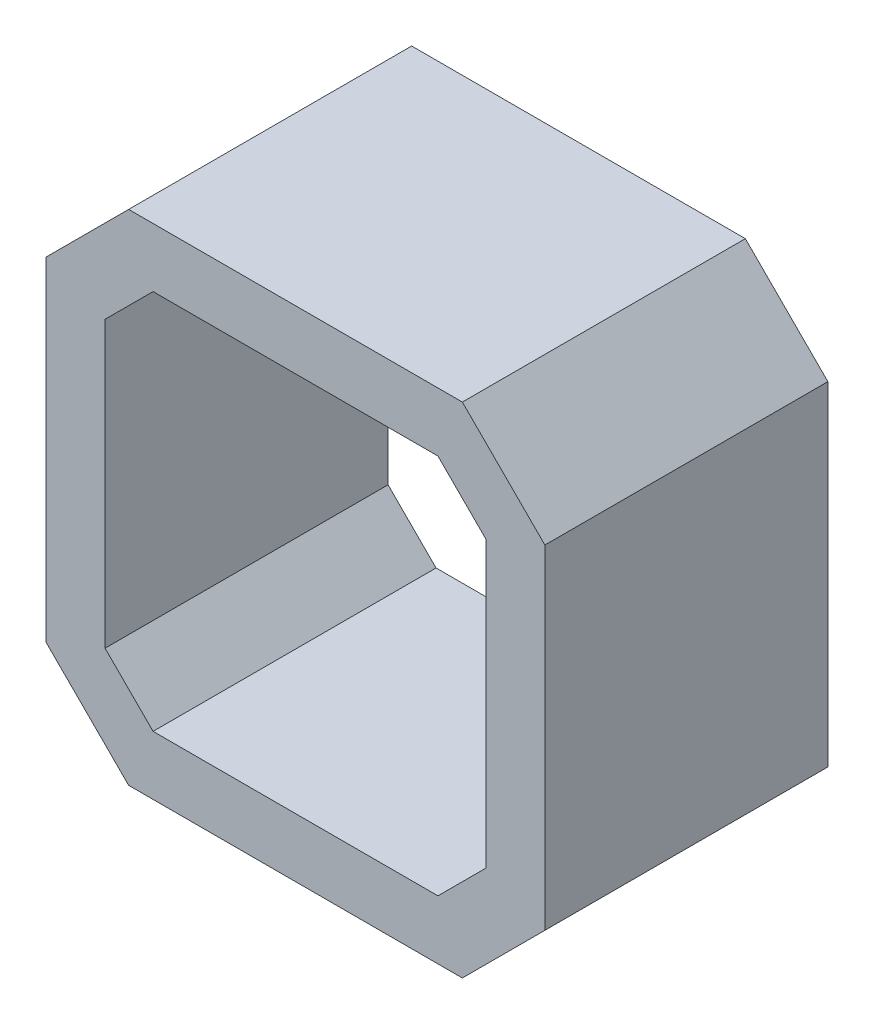
ISO-10303-21;
HEADER;
FILE_DESCRIPTION(('STEP AP214'),'2;1');
FILE_NAME('part.step','',(''),(''),'','','');
FILE_SCHEMA(('AUTOMOTIVE_DESIGN { 1 0 10303 214 1 1 1 1 }'));
ENDSEC;
DATA;
#1=APPLICATION_CONTEXT('core data for automotive mechanical design processes');
#2=APPLICATION_PROTOCOL_DEFINITION('international standard','automotive_design',2000,#1);
#3=PRODUCT_CONTEXT('',#1,'mechanical');
#4=PRODUCT('Part','Part','',(#3));
#5=PRODUCT_RELATED_PRODUCT_CATEGORY('part','',(#4));
#6=PRODUCT_DEFINITION_FORMATION('','',#4);
#7=PRODUCT_DEFINITION_CONTEXT('part definition',#1,'design');
#8=PRODUCT_DEFINITION('design','',#6,#7);
#9=PRODUCT_DEFINITION_SHAPE('','',#8);
#10=(LENGTH_UNIT() NAMED_UNIT(*) SI_UNIT(.MILLI.,.METRE.));
#11=(NAMED_UNIT(*) PLANE_ANGLE_UNIT() SI_UNIT($,.RADIAN.));
#12=(NAMED_UNIT(*) SI_UNIT($,.STERADIAN.) SOLID_ANGLE_UNIT());
#13=UNCERTAINTY_MEASURE_WITH_UNIT(LENGTH_MEASURE(1.E-05),#10,'distance_accuracy_value','');
#14=(GEOMETRIC_REPRESENTATION_CONTEXT(3) GLOBAL_UNCERTAINTY_ASSIGNED_CONTEXT((#13)) GLOBAL_UNIT_ASSIGNED_CONTEXT((#10,
#11,#12)) REPRESENTATION_CONTEXT('',''));
#15=CARTESIAN_POINT('',(0.,0.,0.));
#16=DIRECTION('',(0.,0.,1.));
#17=DIRECTION('',(1.,0.,0.));
#18=AXIS2_PLACEMENT_3D('',#15,#16,#17);
#19=CARTESIAN_POINT('',(0.,0.,24.));
#20=DIRECTION('',(0.,0.,-1.));
#21=DIRECTION('',(-1.,0.,0.));
#22=AXIS2_PLACEMENT_3D('',#19,#20,#21);
#23=PLANE('',#22);
#24=DIRECTION('',(-1.,0.,0.));
#25=VECTOR('',#24,1.);
#26=CARTESIAN_POINT('',(-14.15,21.15,24.));
#27=LINE('',#26,#25);
#28=CARTESIAN_POINT('',(14.15,21.15,24.));
#29=VERTEX_POINT('',#28);
#30=CARTESIAN_POINT('',(-14.15,21.15,24.));
#31=VERTEX_POINT('',#30);
#32=EDGE_CURVE('E214',#29,#31,#27,.T.);
#33=ORIENTED_EDGE('',*,*,#32,.T.);
#34=DIRECTION('',(-0.707106781186547,-0.707106781186547,0.));
#35=VECTOR('',#34,1.);
#36=CARTESIAN_POINT('',(-21.15,14.15,24.));
#37=LINE('',#36,#35);
#38=CARTESIAN_POINT('',(-21.15,14.15,24.));
#39=VERTEX_POINT('',#38);
#40=EDGE_CURVE('E217',#31,#39,#37,.T.);
#41=ORIENTED_EDGE('',*,*,#40,.T.);
#42=DIRECTION('',(0.,-1.,0.));
#43=VECTOR('',#42,1.);
#44=CARTESIAN_POINT('',(-21.15,14.15,24.));
#45=LINE('',#44,#43);
#46=CARTESIAN_POINT('',(-21.15,-14.15,24.));
#47=VERTEX_POINT('',#46);
#48=EDGE_CURVE('E220',#39,#47,#45,.T.);
#49=ORIENTED_EDGE('',*,*,#48,.T.);
#50=DIRECTION('',(0.707106781186547,-0.707106781186547,0.));
#51=VECTOR('',#50,1.);
#52=CARTESIAN_POINT('',(-21.15,-14.15,24.));
#53=LINE('',#52,#51);
#54=CARTESIAN_POINT('',(-14.15,-21.15,24.));
#55=VERTEX_POINT('',#54);
#56=EDGE_CURVE('E222',#47,#55,#53,.T.);
#57=ORIENTED_EDGE('',*,*,#56,.T.);
#58=DIRECTION('',(1.,0.,0.));
#59=VECTOR('',#58,1.);
#60=CARTESIAN_POINT('',(-14.15,-21.15,24.));
#61=LINE('',#60,#59);
#62=CARTESIAN_POINT('',(14.15,-21.15,24.));
#63=VERTEX_POINT('',#62);
#64=EDGE_CURVE('E224',#55,#63,#61,.T.);
#65=ORIENTED_EDGE('',*,*,#64,.T.);
#66=DIRECTION('',(0.707106781186547,0.707106781186547,0.));
#67=VECTOR('',#66,1.);
#68=CARTESIAN_POINT('',(14.15,-21.15,24.));
#69=LINE('',#68,#67);
#70=CARTESIAN_POINT('',(21.15,-14.15,24.));
#71=VERTEX_POINT('',#70);
#72=EDGE_CURVE('E226',#63,#71,#69,.T.);
#73=ORIENTED_EDGE('',*,*,#72,.T.);
#74=DIRECTION('',(0.,1.,0.));
#75=VECTOR('',#74,1.);
#76=CARTESIAN_POINT('',(21.15,14.15,24.));
#77=LINE('',#76,#75);
#78=CARTESIAN_POINT('',(21.15,14.15,24.));
#79=VERTEX_POINT('',#78);
#80=EDGE_CURVE('E228',#71,#79,#77,.T.);
#81=ORIENTED_EDGE('',*,*,#80,.T.);
#82=DIRECTION('',(-0.707106781186547,0.707106781186547,0.));
#83=VECTOR('',#82,1.);
#84=CARTESIAN_POINT('',(14.15,21.15,24.));
#85=LINE('',#84,#83);
#86=EDGE_CURVE('E230',#79,#29,#85,.T.);
#87=ORIENTED_EDGE('',*,*,#86,.T.);
#88=EDGE_LOOP('',(#33,#41,#49,#57,#65,#73,#81,#87));
#89=FACE_BOUND('',#88,.T.);
#90=DIRECTION('',(-0.707106781186547,-0.707106781186547,0.));
#91=VECTOR('',#90,1.);
#92=CARTESIAN_POINT('',(-16.15,12.0789321881345,24.));
#93=LINE('',#92,#91);
#94=CARTESIAN_POINT('',(-12.0789321881345,16.15,24.));
#95=VERTEX_POINT('',#94);
#96=CARTESIAN_POINT('',(-16.15,12.0789321881345,24.));
#97=VERTEX_POINT('',#96);
#98=EDGE_CURVE('E149',#95,#97,#93,.T.);
#99=ORIENTED_EDGE('',*,*,#98,.F.);
#100=DIRECTION('',(-1.,0.,0.));
#101=VECTOR('',#100,1.);
#102=CARTESIAN_POINT('',(-12.0789321881345,16.15,24.));
#103=LINE('',#102,#101);
#104=CARTESIAN_POINT('',(12.0789321881345,16.15,24.));
#105=VERTEX_POINT('',#104);
#106=EDGE_CURVE('E182',#105,#95,#103,.T.);
#107=ORIENTED_EDGE('',*,*,#106,.F.);
#108=DIRECTION('',(-0.707106781186547,0.707106781186547,0.));
#109=VECTOR('',#108,1.);
#110=CARTESIAN_POINT('',(12.0789321881345,16.15,24.));
#111=LINE('',#110,#109);
#112=CARTESIAN_POINT('',(16.15,12.0789321881345,24.));
#113=VERTEX_POINT('',#112);
#114=EDGE_CURVE('E180',#113,#105,#111,.T.);
#115=ORIENTED_EDGE('',*,*,#114,.F.);
#116=DIRECTION('',(0.,1.,0.));
#117=VECTOR('',#116,1.);
#118=CARTESIAN_POINT('',(16.15,12.0789321881345,24.));
#119=LINE('',#118,#117);
#120=CARTESIAN_POINT('',(16.15,-12.0789321881345,24.));
#121=VERTEX_POINT('',#120);
#122=EDGE_CURVE('E178',#121,#113,#119,.T.);
#123=ORIENTED_EDGE('',*,*,#122,.F.);
#124=DIRECTION('',(0.707106781186548,0.707106781186548,0.));
#125=VECTOR('',#124,1.);
#126=CARTESIAN_POINT('',(12.0789321881345,-16.15,24.));
#127=LINE('',#126,#125);
#128=CARTESIAN_POINT('',(12.0789321881345,-16.15,24.));
#129=VERTEX_POINT('',#128);
#130=EDGE_CURVE('E176',#129,#121,#127,.T.);
#131=ORIENTED_EDGE('',*,*,#130,.F.);
#132=DIRECTION('',(1.,0.,0.));
#133=VECTOR('',#132,1.);
#134=CARTESIAN_POINT('',(-12.0789321881345,-16.15,24.));
#135=LINE('',#134,#133);
#136=CARTESIAN_POINT('',(-12.0789321881345,-16.15,24.));
#137=VERTEX_POINT('',#136);
#138=EDGE_CURVE('E172',#137,#129,#135,.T.);
#139=ORIENTED_EDGE('',*,*,#138,.F.);
#140=DIRECTION('',(0.707106781186548,-0.707106781186548,0.));
#141=VECTOR('',#140,1.);
#142=CARTESIAN_POINT('',(-16.15,-12.0789321881345,24.));
#143=LINE('',#142,#141);
#144=CARTESIAN_POINT('',(-16.15,-12.0789321881345,24.));
#145=VERTEX_POINT('',#144);
#146=EDGE_CURVE('E170',#145,#137,#143,.T.);
#147=ORIENTED_EDGE('',*,*,#146,.F.);
#148=DIRECTION('',(0.,-1.,0.));
#149=VECTOR('',#148,1.);
#150=CARTESIAN_POINT('',(-16.15,12.0789321881345,24.));
#151=LINE('',#150,#149);
#152=EDGE_CURVE('E157',#97,#145,#151,.T.);
#153=ORIENTED_EDGE('',*,*,#152,.F.);
#154=EDGE_LOOP('',(#99,#107,#115,#123,#131,#139,#147,#153));
#155=FACE_BOUND('',#154,.T.);
#156=ADVANCED_FACE('F36',(#89,#155),#23,.F.);
#157=CARTESIAN_POINT('',(0.,0.,0.));
#158=DIRECTION('',(0.,0.,-1.));
#159=DIRECTION('',(-1.,0.,0.));
#160=AXIS2_PLACEMENT_3D('',#157,#158,#159);
#161=PLANE('',#160);
#162=DIRECTION('',(-1.,0.,0.));
#163=VECTOR('',#162,1.);
#164=CARTESIAN_POINT('',(-14.15,21.15,0.));
#165=LINE('',#164,#163);
#166=CARTESIAN_POINT('',(14.15,21.15,0.));
#167=VERTEX_POINT('',#166);
#168=CARTESIAN_POINT('',(-14.15,21.15,0.));
#169=VERTEX_POINT('',#168);
#170=EDGE_CURVE('E165',#167,#169,#165,.T.);
#171=ORIENTED_EDGE('',*,*,#170,.F.);
#172=DIRECTION('',(-0.707106781186547,0.707106781186547,0.));
#173=VECTOR('',#172,1.);
#174=CARTESIAN_POINT('',(14.15,21.15,0.));
#175=LINE('',#174,#173);
#176=CARTESIAN_POINT('',(21.15,14.15,0.));
#177=VERTEX_POINT('',#176);
#178=EDGE_CURVE('E218',#177,#167,#175,.T.);
#179=ORIENTED_EDGE('',*,*,#178,.F.);
#180=DIRECTION('',(0.,1.,0.));
#181=VECTOR('',#180,1.);
#182=CARTESIAN_POINT('',(21.15,14.15,0.));
#183=LINE('',#182,#181);
#184=CARTESIAN_POINT('',(21.15,-14.15,0.));
#185=VERTEX_POINT('',#184);
#186=EDGE_CURVE('E245',#185,#177,#183,.T.);
#187=ORIENTED_EDGE('',*,*,#186,.F.);
#188=DIRECTION('',(0.707106781186547,0.707106781186547,0.));
#189=VECTOR('',#188,1.);
#190=CARTESIAN_POINT('',(14.15,-21.15,0.));
#191=LINE('',#190,#189);
#192=CARTESIAN_POINT('',(14.15,-21.15,0.));
#193=VERTEX_POINT('',#192);
#194=EDGE_CURVE('E243',#193,#185,#191,.T.);
#195=ORIENTED_EDGE('',*,*,#194,.F.);
#196=DIRECTION('',(1.,0.,0.));
#197=VECTOR('',#196,1.);
#198=CARTESIAN_POINT('',(-14.15,-21.15,0.));
#199=LINE('',#198,#197);
#200=CARTESIAN_POINT('',(-14.15,-21.15,0.));
#201=VERTEX_POINT('',#200);
#202=EDGE_CURVE('E241',#201,#193,#199,.T.);
#203=ORIENTED_EDGE('',*,*,#202,.F.);
#204=DIRECTION('',(0.707106781186547,-0.707106781186547,0.));
#205=VECTOR('',#204,1.);
#206=CARTESIAN_POINT('',(-21.15,-14.15,0.));
#207=LINE('',#206,#205);
#208=CARTESIAN_POINT('',(-21.15,-14.15,0.));
#209=VERTEX_POINT('',#208);
#210=EDGE_CURVE('E239',#209,#201,#207,.T.);
#211=ORIENTED_EDGE('',*,*,#210,.F.);
#212=DIRECTION('',(0.,-1.,0.));
#213=VECTOR('',#212,1.);
#214=CARTESIAN_POINT('',(-21.15,14.15,0.));
#215=LINE('',#214,#213);
#216=CARTESIAN_POINT('',(-21.15,14.15,0.));
#217=VERTEX_POINT('',#216);
#218=EDGE_CURVE('E237',#217,#209,#215,.T.);
#219=ORIENTED_EDGE('',*,*,#218,.F.);
#220=DIRECTION('',(-0.707106781186547,-0.707106781186547,0.));
#221=VECTOR('',#220,1.);
#222=CARTESIAN_POINT('',(-21.15,14.15,0.));
#223=LINE('',#222,#221);
#224=EDGE_CURVE('E235',#169,#217,#223,.T.);
#225=ORIENTED_EDGE('',*,*,#224,.F.);
#226=EDGE_LOOP('',(#171,#179,#187,#195,#203,#211,#219,#225));
#227=FACE_BOUND('',#226,.T.);
#228=DIRECTION('',(-1.,0.,0.));
#229=VECTOR('',#228,1.);
#230=CARTESIAN_POINT('',(-12.0789321881345,16.15,0.));
#231=LINE('',#230,#229);
#232=CARTESIAN_POINT('',(12.0789321881345,16.15,0.));
#233=VERTEX_POINT('',#232);
#234=CARTESIAN_POINT('',(-12.0789321881345,16.15,0.));
#235=VERTEX_POINT('',#234);
#236=EDGE_CURVE('E158',#233,#235,#231,.T.);
#237=ORIENTED_EDGE('',*,*,#236,.T.);
#238=DIRECTION('',(-0.707106781186547,-0.707106781186547,0.));
#239=VECTOR('',#238,1.);
#240=CARTESIAN_POINT('',(-16.15,12.0789321881345,0.));
#241=LINE('',#240,#239);
#242=CARTESIAN_POINT('',(-16.15,12.0789321881345,0.));
#243=VERTEX_POINT('',#242);
#244=EDGE_CURVE('E59',#235,#243,#241,.T.);
#245=ORIENTED_EDGE('',*,*,#244,.T.);
#246=DIRECTION('',(0.,-1.,0.));
#247=VECTOR('',#246,1.);
#248=CARTESIAN_POINT('',(-16.15,12.0789321881345,0.));
#249=LINE('',#248,#247);
#250=CARTESIAN_POINT('',(-16.15,-12.0789321881345,0.));
#251=VERTEX_POINT('',#250);
#252=EDGE_CURVE('E164',#243,#251,#249,.T.);
#253=ORIENTED_EDGE('',*,*,#252,.T.);
#254=DIRECTION('',(0.707106781186548,-0.707106781186548,0.));
#255=VECTOR('',#254,1.);
#256=CARTESIAN_POINT('',(-16.15,-12.0789321881345,0.));
#257=LINE('',#256,#255);
#258=CARTESIAN_POINT('',(-12.0789321881345,-16.15,0.));
#259=VERTEX_POINT('',#258);
#260=EDGE_CURVE('E186',#251,#259,#257,.T.);
#261=ORIENTED_EDGE('',*,*,#260,.T.);
#262=DIRECTION('',(1.,0.,0.));
#263=VECTOR('',#262,1.);
#264=CARTESIAN_POINT('',(-12.0789321881345,-16.15,0.));
#265=LINE('',#264,#263);
#266=CARTESIAN_POINT('',(12.0789321881345,-16.15,0.));
#267=VERTEX_POINT('',#266);
#268=EDGE_CURVE('E189',#259,#267,#265,.T.);
#269=ORIENTED_EDGE('',*,*,#268,.T.);
#270=DIRECTION('',(0.707106781186548,0.707106781186548,0.));
#271=VECTOR('',#270,1.);
#272=CARTESIAN_POINT('',(12.0789321881345,-16.15,0.));
#273=LINE('',#272,#271);
#274=CARTESIAN_POINT('',(16.15,-12.0789321881345,0.));
#275=VERTEX_POINT('',#274);
#276=EDGE_CURVE('E192',#267,#275,#273,.T.);
#277=ORIENTED_EDGE('',*,*,#276,.T.);
#278=DIRECTION('',(0.,1.,0.));
#279=VECTOR('',#278,1.);
#280=CARTESIAN_POINT('',(16.15,12.0789321881345,0.));
#281=LINE('',#280,#279);
#282=CARTESIAN_POINT('',(16.15,12.0789321881345,0.));
#283=VERTEX_POINT('',#282);
#284=EDGE_CURVE('E195',#275,#283,#281,.T.);
#285=ORIENTED_EDGE('',*,*,#284,.T.);
#286=DIRECTION('',(-0.707106781186547,0.707106781186547,0.));
#287=VECTOR('',#286,1.);
#288=CARTESIAN_POINT('',(12.0789321881345,16.15,0.));
#289=LINE('',#288,#287);
#290=EDGE_CURVE('E198',#283,#233,#289,.T.);
#291=ORIENTED_EDGE('',*,*,#290,.T.);
#292=EDGE_LOOP('',(#237,#245,#253,#261,#269,#277,#285,#291));
#293=FACE_BOUND('',#292,.T.);
#294=ADVANCED_FACE('F275',(#227,#293),#161,.T.);
#295=CARTESIAN_POINT('',(-14.15,21.15,24.));
#296=DIRECTION('',(0.,-1.,0.));
#297=DIRECTION('',(0.,0.,-1.));
#298=AXIS2_PLACEMENT_3D('',#295,#296,#297);
#299=PLANE('',#298);
#300=ORIENTED_EDGE('',*,*,#170,.T.);
#301=DIRECTION('',(0.,0.,-1.));
#302=VECTOR('',#301,1.);
#303=CARTESIAN_POINT('',(-14.15,21.15,24.));
#304=LINE('',#303,#302);
#305=EDGE_CURVE('E11',#31,#169,#304,.T.);
#306=ORIENTED_EDGE('',*,*,#305,.F.);
#307=ORIENTED_EDGE('',*,*,#32,.F.);
#308=DIRECTION('',(0.,0.,-1.));
#309=VECTOR('',#308,1.);
#310=CARTESIAN_POINT('',(14.15,21.15,24.));
#311=LINE('',#310,#309);
#312=EDGE_CURVE('E232',#29,#167,#311,.T.);
#313=ORIENTED_EDGE('',*,*,#312,.T.);
#314=EDGE_LOOP('',(#300,#306,#307,#313));
#315=FACE_BOUND('',#314,.T.);
#316=ADVANCED_FACE('F38',(#315),#299,.F.);
#317=CARTESIAN_POINT('',(-21.15,14.15,24.));
#318=DIRECTION('',(0.707106781186548,-0.707106781186548,0.));
#319=DIRECTION('',(0.707106781186548,0.707106781186548,0.));
#320=AXIS2_PLACEMENT_3D('',#317,#318,#319);
#321=PLANE('',#320);
#322=ORIENTED_EDGE('',*,*,#224,.T.);
#323=DIRECTION('',(0.,0.,-1.));
#324=VECTOR('',#323,1.);
#325=CARTESIAN_POINT('',(-21.15,14.15,24.));
#326=LINE('',#325,#324);
#327=EDGE_CURVE('E44',#39,#217,#326,.T.);
#328=ORIENTED_EDGE('',*,*,#327,.F.);
#329=ORIENTED_EDGE('',*,*,#40,.F.);
#330=ORIENTED_EDGE('',*,*,#305,.T.);
#331=EDGE_LOOP('',(#322,#328,#329,#330));
#332=FACE_BOUND('',#331,.T.);
#333=ADVANCED_FACE('F292',(#332),#321,.F.);
#334=CARTESIAN_POINT('',(-21.15,14.15,24.));
#335=DIRECTION('',(1.,0.,0.));
#336=DIRECTION('',(0.,1.,0.));
#337=AXIS2_PLACEMENT_3D('',#334,#335,#336);
#338=PLANE('',#337);
#339=ORIENTED_EDGE('',*,*,#218,.T.);
#340=DIRECTION('',(0.,0.,-1.));
#341=VECTOR('',#340,1.);
#342=CARTESIAN_POINT('',(-21.15,-14.15,24.));
#343=LINE('',#342,#341);
#344=EDGE_CURVE('E262',#47,#209,#343,.T.);
#345=ORIENTED_EDGE('',*,*,#344,.F.);
#346=ORIENTED_EDGE('',*,*,#48,.F.);
#347=ORIENTED_EDGE('',*,*,#327,.T.);
#348=EDGE_LOOP('',(#339,#345,#346,#347));
#349=FACE_BOUND('',#348,.T.);
#350=ADVANCED_FACE('F269',(#349),#338,.F.);
#351=CARTESIAN_POINT('',(-21.15,-14.15,24.));
#352=DIRECTION('',(0.707106781186548,0.707106781186548,0.));
#353=DIRECTION('',(-0.707106781186548,0.707106781186548,0.));
#354=AXIS2_PLACEMENT_3D('',#351,#352,#353);
#355=PLANE('',#354);
#356=ORIENTED_EDGE('',*,*,#210,.T.);
#357=DIRECTION('',(0.,0.,-1.));
#358=VECTOR('',#357,1.);
#359=CARTESIAN_POINT('',(-14.15,-21.15,24.));
#360=LINE('',#359,#358);
#361=EDGE_CURVE('E259',#55,#201,#360,.T.);
#362=ORIENTED_EDGE('',*,*,#361,.F.);
#363=ORIENTED_EDGE('',*,*,#56,.F.);
#364=ORIENTED_EDGE('',*,*,#344,.T.);
#365=EDGE_LOOP('',(#356,#362,#363,#364));
#366=FACE_BOUND('',#365,.T.);
#367=ADVANCED_FACE('F281',(#366),#355,.F.);
#368=CARTESIAN_POINT('',(-14.15,-21.15,24.));
#369=DIRECTION('',(0.,1.,0.));
#370=DIRECTION('',(0.,0.,1.));
#371=AXIS2_PLACEMENT_3D('',#368,#369,#370);
#372=PLANE('',#371);
#373=ORIENTED_EDGE('',*,*,#202,.T.);
#374=DIRECTION('',(0.,0.,-1.));
#375=VECTOR('',#374,1.);
#376=CARTESIAN_POINT('',(14.15,-21.15,24.));
#377=LINE('',#376,#375);
#378=EDGE_CURVE('E256',#63,#193,#377,.T.);
#379=ORIENTED_EDGE('',*,*,#378,.F.);
#380=ORIENTED_EDGE('',*,*,#64,.F.);
#381=ORIENTED_EDGE('',*,*,#361,.T.);
#382=EDGE_LOOP('',(#373,#379,#380,#381));
#383=FACE_BOUND('',#382,.T.);
#384=ADVANCED_FACE('F285',(#383),#372,.F.);
#385=CARTESIAN_POINT('',(14.15,-21.15,24.));
#386=DIRECTION('',(-0.707106781186548,0.707106781186548,0.));
#387=DIRECTION('',(-0.707106781186548,-0.707106781186548,0.));
#388=AXIS2_PLACEMENT_3D('',#385,#386,#387);
#389=PLANE('',#388);
#390=ORIENTED_EDGE('',*,*,#194,.T.);
#391=DIRECTION('',(0.,0.,-1.));
#392=VECTOR('',#391,1.);
#393=CARTESIAN_POINT('',(21.15,-14.15,24.));
#394=LINE('',#393,#392);
#395=EDGE_CURVE('E253',#71,#185,#394,.T.);
#396=ORIENTED_EDGE('',*,*,#395,.F.);
#397=ORIENTED_EDGE('',*,*,#72,.F.);
#398=ORIENTED_EDGE('',*,*,#378,.T.);
#399=EDGE_LOOP('',(#390,#396,#397,#398));
#400=FACE_BOUND('',#399,.T.);
#401=ADVANCED_FACE('F305',(#400),#389,.F.);
#402=CARTESIAN_POINT('',(21.15,14.15,24.));
#403=DIRECTION('',(-1.,0.,0.));
#404=DIRECTION('',(0.,-1.,0.));
#405=AXIS2_PLACEMENT_3D('',#402,#403,#404);
#406=PLANE('',#405);
#407=ORIENTED_EDGE('',*,*,#186,.T.);
#408=DIRECTION('',(0.,0.,-1.));
#409=VECTOR('',#408,1.);
#410=CARTESIAN_POINT('',(21.15,14.15,24.));
#411=LINE('',#410,#409);
#412=EDGE_CURVE('E250',#79,#177,#411,.T.);
#413=ORIENTED_EDGE('',*,*,#412,.F.);
#414=ORIENTED_EDGE('',*,*,#80,.F.);
#415=ORIENTED_EDGE('',*,*,#395,.T.);
#416=EDGE_LOOP('',(#407,#413,#414,#415));
#417=FACE_BOUND('',#416,.T.);
#418=ADVANCED_FACE('F303',(#417),#406,.F.);
#419=CARTESIAN_POINT('',(14.15,21.15,24.));
#420=DIRECTION('',(-0.707106781186548,-0.707106781186548,0.));
#421=DIRECTION('',(0.707106781186548,-0.707106781186548,0.));
#422=AXIS2_PLACEMENT_3D('',#419,#420,#421);
#423=PLANE('',#422);
#424=ORIENTED_EDGE('',*,*,#178,.T.);
#425=ORIENTED_EDGE('',*,*,#312,.F.);
#426=ORIENTED_EDGE('',*,*,#86,.F.);
#427=ORIENTED_EDGE('',*,*,#412,.T.);
#428=EDGE_LOOP('',(#424,#425,#426,#427));
#429=FACE_BOUND('',#428,.T.);
#430=ADVANCED_FACE('F298',(#429),#423,.F.);
#431=CARTESIAN_POINT('',(-16.15,12.0789321881345,24.));
#432=DIRECTION('',(0.707106781186548,-0.707106781186548,0.));
#433=DIRECTION('',(0.707106781186548,0.707106781186548,0.));
#434=AXIS2_PLACEMENT_3D('',#431,#432,#433);
#435=PLANE('',#434);
#436=ORIENTED_EDGE('',*,*,#244,.F.);
#437=DIRECTION('',(0.,0.,-1.));
#438=VECTOR('',#437,1.);
#439=CARTESIAN_POINT('',(-12.0789321881345,16.15,24.));
#440=LINE('',#439,#438);
#441=EDGE_CURVE('E153',#95,#235,#440,.T.);
#442=ORIENTED_EDGE('',*,*,#441,.F.);
#443=ORIENTED_EDGE('',*,*,#98,.T.);
#444=DIRECTION('',(0.,0.,-1.));
#445=VECTOR('',#444,1.);
#446=CARTESIAN_POINT('',(-16.15,12.0789321881345,24.));
#447=LINE('',#446,#445);
#448=EDGE_CURVE('E152',#97,#243,#447,.T.);
#449=ORIENTED_EDGE('',*,*,#448,.T.);
#450=EDGE_LOOP('',(#436,#442,#443,#449));
#451=FACE_BOUND('',#450,.T.);
#452=ADVANCED_FACE('F151',(#451),#435,.T.);
#453=CARTESIAN_POINT('',(-16.15,12.0789321881345,24.));
#454=DIRECTION('',(1.,0.,0.));
#455=DIRECTION('',(0.,0.,-1.));
#456=AXIS2_PLACEMENT_3D('',#453,#454,#455);
#457=PLANE('',#456);
#458=ORIENTED_EDGE('',*,*,#252,.F.);
#459=ORIENTED_EDGE('',*,*,#448,.F.);
#460=ORIENTED_EDGE('',*,*,#152,.T.);
#461=DIRECTION('',(0.,0.,-1.));
#462=VECTOR('',#461,1.);
#463=CARTESIAN_POINT('',(-16.15,-12.0789321881345,24.));
#464=LINE('',#463,#462);
#465=EDGE_CURVE('E166',#145,#251,#464,.T.);
#466=ORIENTED_EDGE('',*,*,#465,.T.);
#467=EDGE_LOOP('',(#458,#459,#460,#466));
#468=FACE_BOUND('',#467,.T.);
#469=ADVANCED_FACE('F161',(#468),#457,.T.);
#470=CARTESIAN_POINT('',(-16.15,-12.0789321881345,24.));
#471=DIRECTION('',(0.707106781186547,0.707106781186547,0.));
#472=DIRECTION('',(-0.707106781186548,0.707106781186548,0.));
#473=AXIS2_PLACEMENT_3D('',#470,#471,#472);
#474=PLANE('',#473);
#475=ORIENTED_EDGE('',*,*,#260,.F.);
#476=ORIENTED_EDGE('',*,*,#465,.F.);
#477=ORIENTED_EDGE('',*,*,#146,.T.);
#478=DIRECTION('',(0.,0.,-1.));
#479=VECTOR('',#478,1.);
#480=CARTESIAN_POINT('',(-12.0789321881345,-16.15,24.));
#481=LINE('',#480,#479);
#482=EDGE_CURVE('E211',#137,#259,#481,.T.);
#483=ORIENTED_EDGE('',*,*,#482,.T.);
#484=EDGE_LOOP('',(#475,#476,#477,#483));
#485=FACE_BOUND('',#484,.T.);
#486=ADVANCED_FACE('F330',(#485),#474,.T.);
#487=CARTESIAN_POINT('',(-12.0789321881345,-16.15,24.));
#488=DIRECTION('',(0.,1.,0.));
#489=DIRECTION('',(0.,0.,1.));
#490=AXIS2_PLACEMENT_3D('',#487,#488,#489);
#491=PLANE('',#490);
#492=ORIENTED_EDGE('',*,*,#268,.F.);
#493=ORIENTED_EDGE('',*,*,#482,.F.);
#494=ORIENTED_EDGE('',*,*,#138,.T.);
#495=DIRECTION('',(0.,0.,-1.));
#496=VECTOR('',#495,1.);
#497=CARTESIAN_POINT('',(12.0789321881345,-16.15,24.));
#498=LINE('',#497,#496);
#499=EDGE_CURVE('E209',#129,#267,#498,.T.);
#500=ORIENTED_EDGE('',*,*,#499,.T.);
#501=EDGE_LOOP('',(#492,#493,#494,#500));
#502=FACE_BOUND('',#501,.T.);
#503=ADVANCED_FACE('F334',(#502),#491,.T.);
#504=CARTESIAN_POINT('',(12.0789321881345,-16.15,24.));
#505=DIRECTION('',(-0.707106781186547,0.707106781186547,0.));
#506=DIRECTION('',(-0.707106781186548,-0.707106781186548,0.));
#507=AXIS2_PLACEMENT_3D('',#504,#505,#506);
#508=PLANE('',#507);
#509=ORIENTED_EDGE('',*,*,#276,.F.);
#510=ORIENTED_EDGE('',*,*,#499,.F.);
#511=ORIENTED_EDGE('',*,*,#130,.T.);
#512=DIRECTION('',(0.,0.,-1.));
#513=VECTOR('',#512,1.);
#514=CARTESIAN_POINT('',(16.15,-12.0789321881345,24.));
#515=LINE('',#514,#513);
#516=EDGE_CURVE('E207',#121,#275,#515,.T.);
#517=ORIENTED_EDGE('',*,*,#516,.T.);
#518=EDGE_LOOP('',(#509,#510,#511,#517));
#519=FACE_BOUND('',#518,.T.);
#520=ADVANCED_FACE('F340',(#519),#508,.T.);
#521=CARTESIAN_POINT('',(16.15,12.0789321881345,24.));
#522=DIRECTION('',(-1.,0.,0.));
#523=DIRECTION('',(0.,0.,1.));
#524=AXIS2_PLACEMENT_3D('',#521,#522,#523);
#525=PLANE('',#524);
#526=ORIENTED_EDGE('',*,*,#284,.F.);
#527=ORIENTED_EDGE('',*,*,#516,.F.);
#528=ORIENTED_EDGE('',*,*,#122,.T.);
#529=DIRECTION('',(0.,0.,-1.));
#530=VECTOR('',#529,1.);
#531=CARTESIAN_POINT('',(16.15,12.0789321881345,24.));
#532=LINE('',#531,#530);
#533=EDGE_CURVE('E205',#113,#283,#532,.T.);
#534=ORIENTED_EDGE('',*,*,#533,.T.);
#535=EDGE_LOOP('',(#526,#527,#528,#534));
#536=FACE_BOUND('',#535,.T.);
#537=ADVANCED_FACE('F344',(#536),#525,.T.);
#538=CARTESIAN_POINT('',(12.0789321881345,16.15,24.));
#539=DIRECTION('',(-0.707106781186548,-0.707106781186548,0.));
#540=DIRECTION('',(0.707106781186548,-0.707106781186548,0.));
#541=AXIS2_PLACEMENT_3D('',#538,#539,#540);
#542=PLANE('',#541);
#543=ORIENTED_EDGE('',*,*,#290,.F.);
#544=ORIENTED_EDGE('',*,*,#533,.F.);
#545=ORIENTED_EDGE('',*,*,#114,.T.);
#546=DIRECTION('',(0.,0.,-1.));
#547=VECTOR('',#546,1.);
#548=CARTESIAN_POINT('',(12.0789321881345,16.15,24.));
#549=LINE('',#548,#547);
#550=EDGE_CURVE('E51',#105,#233,#549,.T.);
#551=ORIENTED_EDGE('',*,*,#550,.T.);
#552=EDGE_LOOP('',(#543,#544,#545,#551));
#553=FACE_BOUND('',#552,.T.);
#554=ADVANCED_FACE('F348',(#553),#542,.T.);
#555=CARTESIAN_POINT('',(-12.0789321881345,16.15,24.));
#556=DIRECTION('',(0.,-1.,0.));
#557=DIRECTION('',(0.,0.,-1.));
#558=AXIS2_PLACEMENT_3D('',#555,#556,#557);
#559=PLANE('',#558);
#560=ORIENTED_EDGE('',*,*,#236,.F.);
#561=ORIENTED_EDGE('',*,*,#550,.F.);
#562=ORIENTED_EDGE('',*,*,#106,.T.);
#563=ORIENTED_EDGE('',*,*,#441,.T.);
#564=EDGE_LOOP('',(#560,#561,#562,#563));
#565=FACE_BOUND('',#564,.T.);
#566=ADVANCED_FACE('F352',(#565),#559,.T.);
#567=CLOSED_SHELL('',(#156,#294,#316,#333,#350,#367,#384,#401,#418,#430,#452,#469,#486,#503,
#520,#537,#554,#566));
#568=MANIFOLD_SOLID_BREP('B2',#567);
#569=ADVANCED_BREP_SHAPE_REPRESENTATION('',(#18,#568),#14);
#570=SHAPE_DEFINITION_REPRESENTATION(#9,#569);
ENDSEC;
END-ISO-10303-21;
